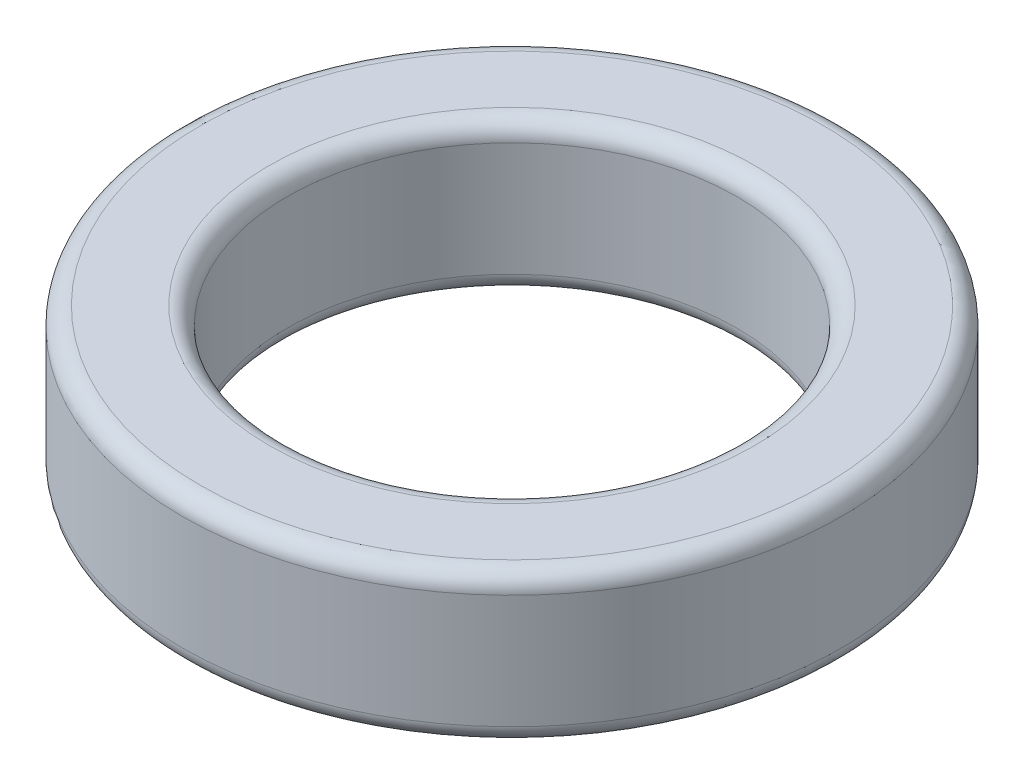
ISO-10303-21;
HEADER;
FILE_DESCRIPTION(('STEP AP214'),'2;1');
FILE_NAME('part.step','',(''),(''),'','','');
FILE_SCHEMA(('AUTOMOTIVE_DESIGN { 1 0 10303 214 1 1 1 1 }'));
ENDSEC;
DATA;
#1=APPLICATION_CONTEXT('core data for automotive mechanical design processes');
#2=APPLICATION_PROTOCOL_DEFINITION('international standard','automotive_design',2000,#1);
#3=PRODUCT_CONTEXT('',#1,'mechanical');
#4=PRODUCT('Part','Part','',(#3));
#5=PRODUCT_RELATED_PRODUCT_CATEGORY('part','',(#4));
#6=PRODUCT_DEFINITION_FORMATION('','',#4);
#7=PRODUCT_DEFINITION_CONTEXT('part definition',#1,'design');
#8=PRODUCT_DEFINITION('design','',#6,#7);
#9=PRODUCT_DEFINITION_SHAPE('','',#8);
#10=(LENGTH_UNIT() NAMED_UNIT(*) SI_UNIT(.MILLI.,.METRE.));
#11=(NAMED_UNIT(*) PLANE_ANGLE_UNIT() SI_UNIT($,.RADIAN.));
#12=(NAMED_UNIT(*) SI_UNIT($,.STERADIAN.) SOLID_ANGLE_UNIT());
#13=UNCERTAINTY_MEASURE_WITH_UNIT(LENGTH_MEASURE(1.E-05),#10,'distance_accuracy_value','');
#14=(GEOMETRIC_REPRESENTATION_CONTEXT(3) GLOBAL_UNCERTAINTY_ASSIGNED_CONTEXT((#13)) GLOBAL_UNIT_ASSIGNED_CONTEXT((#10,
#11,#12)) REPRESENTATION_CONTEXT('',''));
#15=CARTESIAN_POINT('',(0.,0.,0.));
#16=DIRECTION('',(0.,0.,1.));
#17=DIRECTION('',(1.,0.,0.));
#18=AXIS2_PLACEMENT_3D('',#15,#16,#17);
#19=CARTESIAN_POINT('',(5.5,0.,0.));
#20=DIRECTION('',(0.,-1.,0.));
#21=DIRECTION('',(0.,0.,-1.));
#22=AXIS2_PLACEMENT_3D('',#19,#20,#21);
#23=PLANE('',#22);
#24=CARTESIAN_POINT('',(0.,0.,0.));
#25=DIRECTION('',(0.,-1.,0.));
#26=DIRECTION('',(0.,0.,-1.));
#27=AXIS2_PLACEMENT_3D('',#24,#25,#26);
#28=CIRCLE('',#27,5.2);
#29=CARTESIAN_POINT('',(0.,0.,-5.2));
#30=VERTEX_POINT('',#29);
#31=EDGE_CURVE('E40',#30,#30,#28,.T.);
#32=ORIENTED_EDGE('',*,*,#31,.T.);
#33=EDGE_LOOP('',(#32));
#34=FACE_BOUND('',#33,.T.);
#35=CARTESIAN_POINT('',(0.,0.,0.));
#36=DIRECTION('',(0.,-1.,0.));
#37=DIRECTION('',(0.,0.,-1.));
#38=AXIS2_PLACEMENT_3D('',#35,#36,#37);
#39=CIRCLE('',#38,4.05);
#40=CARTESIAN_POINT('',(0.,0.,-4.05));
#41=VERTEX_POINT('',#40);
#42=EDGE_CURVE('E44',#41,#41,#39,.F.);
#43=ORIENTED_EDGE('',*,*,#42,.T.);
#44=EDGE_LOOP('',(#43));
#45=FACE_BOUND('',#44,.T.);
#46=ADVANCED_FACE('F29',(#34,#45),#23,.T.);
#47=CARTESIAN_POINT('',(0.,0.,0.));
#48=DIRECTION('',(0.,-1.,0.));
#49=DIRECTION('',(0.,0.,-1.));
#50=AXIS2_PLACEMENT_3D('',#47,#48,#49);
#51=CYLINDRICAL_SURFACE('',#50,3.75);
#52=CARTESIAN_POINT('',(0.,0.299999999999999,0.));
#53=DIRECTION('',(0.,-1.,0.));
#54=DIRECTION('',(0.,0.,-1.));
#55=AXIS2_PLACEMENT_3D('',#52,#53,#54);
#56=CIRCLE('',#55,3.75);
#57=CARTESIAN_POINT('',(0.,0.299999999999999,-3.75));
#58=VERTEX_POINT('',#57);
#59=EDGE_CURVE('E10',#58,#58,#56,.T.);
#60=ORIENTED_EDGE('',*,*,#59,.T.);
#61=EDGE_LOOP('',(#60));
#62=FACE_BOUND('',#61,.T.);
#63=CARTESIAN_POINT('',(0.,2.2,0.));
#64=DIRECTION('',(0.,1.,0.));
#65=DIRECTION('',(0.,0.,1.));
#66=AXIS2_PLACEMENT_3D('',#63,#64,#65);
#67=CIRCLE('',#66,3.75);
#68=CARTESIAN_POINT('',(0.,2.2,3.75));
#69=VERTEX_POINT('',#68);
#70=EDGE_CURVE('E36',#69,#69,#67,.T.);
#71=ORIENTED_EDGE('',*,*,#70,.T.);
#72=EDGE_LOOP('',(#71));
#73=FACE_BOUND('',#72,.T.);
#74=ADVANCED_FACE('F74',(#62,#73),#51,.F.);
#75=CARTESIAN_POINT('',(3.75,2.5,0.));
#76=DIRECTION('',(0.,1.,0.));
#77=DIRECTION('',(0.,0.,1.));
#78=AXIS2_PLACEMENT_3D('',#75,#76,#77);
#79=PLANE('',#78);
#80=CARTESIAN_POINT('',(0.,2.5,0.));
#81=DIRECTION('',(0.,1.,0.));
#82=DIRECTION('',(0.,0.,1.));
#83=AXIS2_PLACEMENT_3D('',#80,#81,#82);
#84=CIRCLE('',#83,5.2);
#85=CARTESIAN_POINT('',(0.,2.5,5.2));
#86=VERTEX_POINT('',#85);
#87=EDGE_CURVE('E49',#86,#86,#84,.T.);
#88=ORIENTED_EDGE('',*,*,#87,.T.);
#89=EDGE_LOOP('',(#88));
#90=FACE_BOUND('',#89,.T.);
#91=CARTESIAN_POINT('',(0.,2.5,0.));
#92=DIRECTION('',(0.,1.,0.));
#93=DIRECTION('',(0.,0.,1.));
#94=AXIS2_PLACEMENT_3D('',#91,#92,#93);
#95=CIRCLE('',#94,4.05);
#96=CARTESIAN_POINT('',(0.,2.5,4.05));
#97=VERTEX_POINT('',#96);
#98=EDGE_CURVE('E52',#97,#97,#95,.F.);
#99=ORIENTED_EDGE('',*,*,#98,.T.);
#100=EDGE_LOOP('',(#99));
#101=FACE_BOUND('',#100,.T.);
#102=ADVANCED_FACE('F90',(#90,#101),#79,.T.);
#103=CARTESIAN_POINT('',(0.,0.,0.));
#104=DIRECTION('',(0.,-1.,0.));
#105=DIRECTION('',(0.,0.,-1.));
#106=AXIS2_PLACEMENT_3D('',#103,#104,#105);
#107=CYLINDRICAL_SURFACE('',#106,5.5);
#108=CARTESIAN_POINT('',(0.,2.2,0.));
#109=DIRECTION('',(0.,1.,0.));
#110=DIRECTION('',(0.,0.,1.));
#111=AXIS2_PLACEMENT_3D('',#108,#109,#110);
#112=CIRCLE('',#111,5.5);
#113=CARTESIAN_POINT('',(0.,2.2,5.5));
#114=VERTEX_POINT('',#113);
#115=EDGE_CURVE('E55',#114,#114,#112,.F.);
#116=ORIENTED_EDGE('',*,*,#115,.T.);
#117=EDGE_LOOP('',(#116));
#118=FACE_BOUND('',#117,.T.);
#119=CARTESIAN_POINT('',(0.,0.299999999999999,0.));
#120=DIRECTION('',(0.,-1.,0.));
#121=DIRECTION('',(0.,0.,-1.));
#122=AXIS2_PLACEMENT_3D('',#119,#120,#121);
#123=CIRCLE('',#122,5.5);
#124=CARTESIAN_POINT('',(0.,0.299999999999999,-5.5));
#125=VERTEX_POINT('',#124);
#126=EDGE_CURVE('E58',#125,#125,#123,.F.);
#127=ORIENTED_EDGE('',*,*,#126,.T.);
#128=EDGE_LOOP('',(#127));
#129=FACE_BOUND('',#128,.T.);
#130=ADVANCED_FACE('F62',(#118,#129),#107,.T.);
#131=CARTESIAN_POINT('',(0.,2.2,0.));
#132=DIRECTION('',(0.,1.,0.));
#133=DIRECTION('',(0.,0.,1.));
#134=AXIS2_PLACEMENT_3D('',#131,#132,#133);
#135=TOROIDAL_SURFACE('',#134,5.2,0.3);
#136=ORIENTED_EDGE('',*,*,#87,.F.);
#137=EDGE_LOOP('',(#136));
#138=FACE_BOUND('',#137,.T.);
#139=ORIENTED_EDGE('',*,*,#115,.F.);
#140=EDGE_LOOP('',(#139));
#141=FACE_BOUND('',#140,.T.);
#142=ADVANCED_FACE('F68',(#138,#141),#135,.T.);
#143=CARTESIAN_POINT('',(0.,0.299999999999999,0.));
#144=DIRECTION('',(0.,-1.,0.));
#145=DIRECTION('',(0.,0.,-1.));
#146=AXIS2_PLACEMENT_3D('',#143,#144,#145);
#147=TOROIDAL_SURFACE('',#146,5.2,0.3);
#148=ORIENTED_EDGE('',*,*,#126,.F.);
#149=EDGE_LOOP('',(#148));
#150=FACE_BOUND('',#149,.T.);
#151=ORIENTED_EDGE('',*,*,#31,.F.);
#152=EDGE_LOOP('',(#151));
#153=FACE_BOUND('',#152,.T.);
#154=ADVANCED_FACE('F64',(#150,#153),#147,.T.);
#155=CARTESIAN_POINT('',(0.,0.299999999999999,0.));
#156=DIRECTION('',(0.,-1.,0.));
#157=DIRECTION('',(0.,0.,-1.));
#158=AXIS2_PLACEMENT_3D('',#155,#156,#157);
#159=TOROIDAL_SURFACE('',#158,4.05,0.3);
#160=ORIENTED_EDGE('',*,*,#42,.F.);
#161=EDGE_LOOP('',(#160));
#162=FACE_BOUND('',#161,.T.);
#163=ORIENTED_EDGE('',*,*,#59,.F.);
#164=EDGE_LOOP('',(#163));
#165=FACE_BOUND('',#164,.T.);
#166=ADVANCED_FACE('F67',(#162,#165),#159,.T.);
#167=CARTESIAN_POINT('',(0.,2.2,0.));
#168=DIRECTION('',(0.,1.,0.));
#169=DIRECTION('',(0.,0.,1.));
#170=AXIS2_PLACEMENT_3D('',#167,#168,#169);
#171=TOROIDAL_SURFACE('',#170,4.05,0.3);
#172=ORIENTED_EDGE('',*,*,#70,.F.);
#173=EDGE_LOOP('',(#172));
#174=FACE_BOUND('',#173,.T.);
#175=ORIENTED_EDGE('',*,*,#98,.F.);
#176=EDGE_LOOP('',(#175));
#177=FACE_BOUND('',#176,.T.);
#178=ADVANCED_FACE('F31',(#174,#177),#171,.T.);
#179=CLOSED_SHELL('',(#46,#74,#102,#130,#142,#154,#166,#178));
#180=MANIFOLD_SOLID_BREP('B2',#179);
#181=ADVANCED_BREP_SHAPE_REPRESENTATION('',(#18,#180),#14);
#182=SHAPE_DEFINITION_REPRESENTATION(#9,#181);
ENDSEC;
END-ISO-10303-21;
